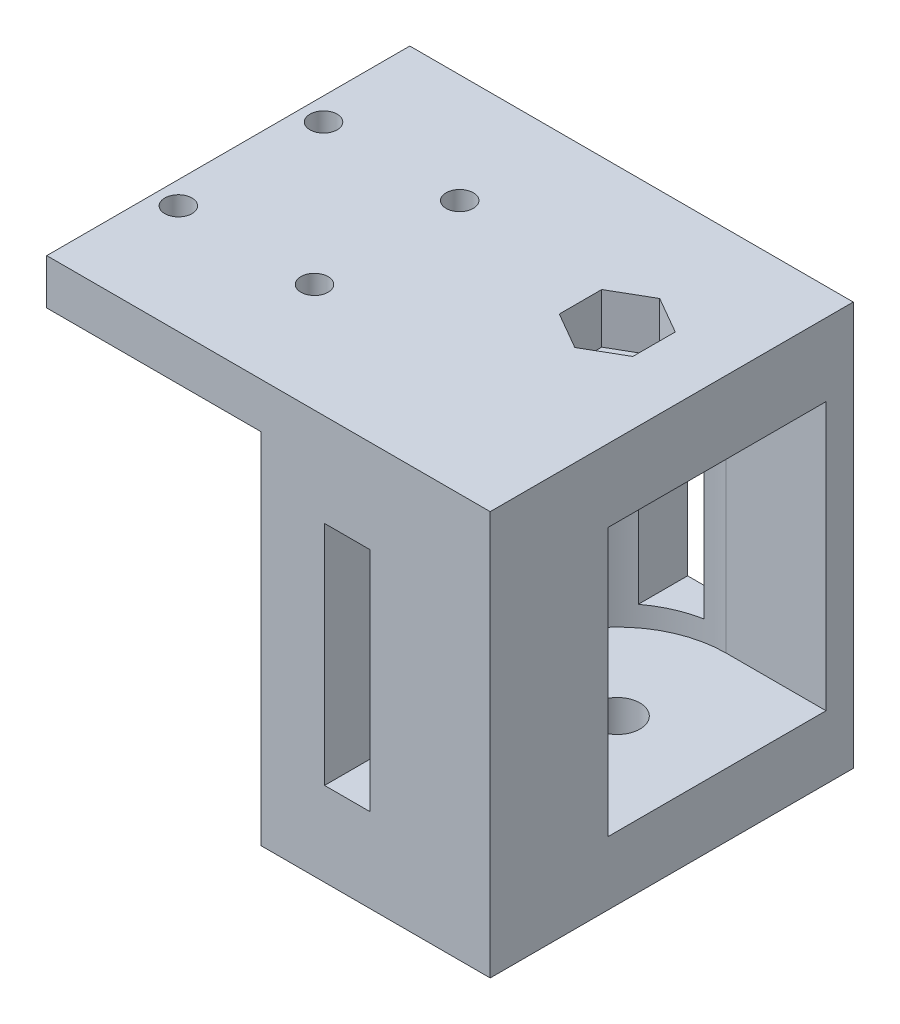
ISO-10303-21;
HEADER;
FILE_DESCRIPTION(('STEP AP214'),'2;1');
FILE_NAME('part.step','',(''),(''),'','','');
FILE_SCHEMA(('AUTOMOTIVE_DESIGN { 1 0 10303 214 1 1 1 1 }'));
ENDSEC;
DATA;
#1=APPLICATION_CONTEXT('core data for automotive mechanical design processes');
#2=APPLICATION_PROTOCOL_DEFINITION('international standard','automotive_design',2000,#1);
#3=PRODUCT_CONTEXT('',#1,'mechanical');
#4=PRODUCT('Part','Part','',(#3));
#5=PRODUCT_RELATED_PRODUCT_CATEGORY('part','',(#4));
#6=PRODUCT_DEFINITION_FORMATION('','',#4);
#7=PRODUCT_DEFINITION_CONTEXT('part definition',#1,'design');
#8=PRODUCT_DEFINITION('design','',#6,#7);
#9=PRODUCT_DEFINITION_SHAPE('','',#8);
#10=(LENGTH_UNIT() NAMED_UNIT(*) SI_UNIT(.MILLI.,.METRE.));
#11=(NAMED_UNIT(*) PLANE_ANGLE_UNIT() SI_UNIT($,.RADIAN.));
#12=(NAMED_UNIT(*) SI_UNIT($,.STERADIAN.) SOLID_ANGLE_UNIT());
#13=UNCERTAINTY_MEASURE_WITH_UNIT(LENGTH_MEASURE(1.E-05),#10,'distance_accuracy_value','');
#14=(GEOMETRIC_REPRESENTATION_CONTEXT(3) GLOBAL_UNCERTAINTY_ASSIGNED_CONTEXT((#13)) GLOBAL_UNIT_ASSIGNED_CONTEXT((#10,
#11,#12)) REPRESENTATION_CONTEXT('',''));
#15=CARTESIAN_POINT('',(0.,0.,0.));
#16=DIRECTION('',(0.,0.,1.));
#17=DIRECTION('',(1.,0.,0.));
#18=AXIS2_PLACEMENT_3D('',#15,#16,#17);
#19=CARTESIAN_POINT('',(37.86,-22.25,0.));
#20=DIRECTION('',(0.,1.,0.));
#21=DIRECTION('',(0.,0.,1.));
#22=AXIS2_PLACEMENT_3D('',#19,#20,#21);
#23=CYLINDRICAL_SURFACE('',#22,2.5);
#24=CARTESIAN_POINT('',(37.86,14.25,0.));
#25=DIRECTION('',(0.,1.,0.));
#26=DIRECTION('',(0.,0.,1.));
#27=AXIS2_PLACEMENT_3D('',#24,#25,#26);
#28=CIRCLE('',#27,2.5);
#29=CARTESIAN_POINT('',(37.86,14.25,2.5));
#30=VERTEX_POINT('',#29);
#31=EDGE_CURVE('E260',#30,#30,#28,.T.);
#32=ORIENTED_EDGE('',*,*,#31,.F.);
#33=EDGE_LOOP('',(#32));
#34=FACE_BOUND('',#33,.T.);
#35=CARTESIAN_POINT('',(37.86,16.75,0.));
#36=DIRECTION('',(0.,1.,0.));
#37=DIRECTION('',(-1.,0.,0.));
#38=AXIS2_PLACEMENT_3D('',#35,#36,#37);
#39=CIRCLE('',#38,2.5);
#40=CARTESIAN_POINT('',(35.36,16.75,0.));
#41=VERTEX_POINT('',#40);
#42=EDGE_CURVE('E39',#41,#41,#39,.F.);
#43=ORIENTED_EDGE('',*,*,#42,.F.);
#44=EDGE_LOOP('',(#43));
#45=FACE_BOUND('',#44,.T.);
#46=ADVANCED_FACE('F35',(#34,#45),#23,.F.);
#47=CARTESIAN_POINT('',(30.61,0.,-15.));
#48=DIRECTION('',(1.,0.,0.));
#49=DIRECTION('',(0.,0.,-1.));
#50=AXIS2_PLACEMENT_3D('',#47,#48,#49);
#51=PLANE('',#50);
#52=DIRECTION('',(0.,1.,0.));
#53=VECTOR('',#52,1.);
#54=CARTESIAN_POINT('',(30.61,-15.25,-9.56229574945264));
#55=LINE('',#54,#53);
#56=CARTESIAN_POINT('',(30.61,-13.,-9.56229574945264));
#57=VERTEX_POINT('',#56);
#58=CARTESIAN_POINT('',(30.61,12.,-9.56229574945264));
#59=VERTEX_POINT('',#58);
#60=EDGE_CURVE('E299',#57,#59,#55,.T.);
#61=ORIENTED_EDGE('',*,*,#60,.F.);
#62=DIRECTION('',(0.,0.,1.));
#63=VECTOR('',#62,1.);
#64=CARTESIAN_POINT('',(30.61,-13.,-15.));
#65=LINE('',#64,#63);
#66=CARTESIAN_POINT('',(30.61,-13.,-15.));
#67=VERTEX_POINT('',#66);
#68=EDGE_CURVE('E364',#67,#57,#65,.T.);
#69=ORIENTED_EDGE('',*,*,#68,.F.);
#70=DIRECTION('',(0.,1.,0.));
#71=VECTOR('',#70,1.);
#72=CARTESIAN_POINT('',(30.61,0.,-15.));
#73=LINE('',#72,#71);
#74=CARTESIAN_POINT('',(30.61,12.,-15.));
#75=VERTEX_POINT('',#74);
#76=EDGE_CURVE('E352',#67,#75,#73,.T.);
#77=ORIENTED_EDGE('',*,*,#76,.T.);
#78=DIRECTION('',(0.,0.,1.));
#79=VECTOR('',#78,1.);
#80=CARTESIAN_POINT('',(30.61,12.,-15.));
#81=LINE('',#80,#79);
#82=EDGE_CURVE('E376',#75,#59,#81,.T.);
#83=ORIENTED_EDGE('',*,*,#82,.T.);
#84=EDGE_LOOP('',(#61,#69,#77,#83));
#85=FACE_BOUND('',#84,.T.);
#86=ADVANCED_FACE('F397',(#85),#51,.T.);
#87=CARTESIAN_POINT('',(0.,-13.,-15.));
#88=DIRECTION('',(0.,-1.,0.));
#89=DIRECTION('',(0.,0.,-1.));
#90=AXIS2_PLACEMENT_3D('',#87,#88,#89);
#91=PLANE('',#90);
#92=DIRECTION('',(0.,0.,1.));
#93=VECTOR('',#92,1.);
#94=CARTESIAN_POINT('',(35.61,-13.,-15.));
#95=LINE('',#94,#93);
#96=CARTESIAN_POINT('',(35.61,-13.,11.7871752341263));
#97=VERTEX_POINT('',#96);
#98=CARTESIAN_POINT('',(35.61,-13.,25.));
#99=VERTEX_POINT('',#98);
#100=EDGE_CURVE('E371',#97,#99,#95,.T.);
#101=ORIENTED_EDGE('',*,*,#100,.F.);
#102=CARTESIAN_POINT('',(37.86,-13.,0.));
#103=DIRECTION('',(0.,-1.,0.));
#104=DIRECTION('',(0.,0.,-1.));
#105=AXIS2_PLACEMENT_3D('',#102,#103,#104);
#106=CIRCLE('',#105,12.);
#107=CARTESIAN_POINT('',(30.61,-13.,9.56229574945264));
#108=VERTEX_POINT('',#107);
#109=EDGE_CURVE('E300',#97,#108,#106,.T.);
#110=ORIENTED_EDGE('',*,*,#109,.T.);
#111=CARTESIAN_POINT('',(30.61,-13.,25.));
#112=VERTEX_POINT('',#111);
#113=EDGE_CURVE('E367',#108,#112,#65,.T.);
#114=ORIENTED_EDGE('',*,*,#113,.T.);
#115=DIRECTION('',(1.,0.,0.));
#116=VECTOR('',#115,1.);
#117=CARTESIAN_POINT('',(0.,-13.,25.));
#118=LINE('',#117,#116);
#119=EDGE_CURVE('E334',#112,#99,#118,.T.);
#120=ORIENTED_EDGE('',*,*,#119,.T.);
#121=EDGE_LOOP('',(#101,#110,#114,#120));
#122=FACE_BOUND('',#121,.T.);
#123=ADVANCED_FACE('F465',(#122),#91,.F.);
#124=CARTESIAN_POINT('',(35.61,0.,-15.));
#125=DIRECTION('',(1.,0.,0.));
#126=DIRECTION('',(0.,0.,-1.));
#127=AXIS2_PLACEMENT_3D('',#124,#125,#126);
#128=PLANE('',#127);
#129=CARTESIAN_POINT('',(35.61,-13.,-15.));
#130=VERTEX_POINT('',#129);
#131=CARTESIAN_POINT('',(35.61,-13.,-11.7871752341263));
#132=VERTEX_POINT('',#131);
#133=EDGE_CURVE('E368',#130,#132,#95,.T.);
#134=ORIENTED_EDGE('',*,*,#133,.T.);
#135=DIRECTION('',(0.,1.,0.));
#136=VECTOR('',#135,1.);
#137=CARTESIAN_POINT('',(35.61,-15.25,-11.7871752341263));
#138=LINE('',#137,#136);
#139=CARTESIAN_POINT('',(35.61,12.,-11.7871752341263));
#140=VERTEX_POINT('',#139);
#141=EDGE_CURVE('E287',#132,#140,#138,.T.);
#142=ORIENTED_EDGE('',*,*,#141,.T.);
#143=DIRECTION('',(0.,0.,1.));
#144=VECTOR('',#143,1.);
#145=CARTESIAN_POINT('',(35.61,12.,-15.));
#146=LINE('',#145,#144);
#147=CARTESIAN_POINT('',(35.61,12.,-15.));
#148=VERTEX_POINT('',#147);
#149=EDGE_CURVE('E372',#148,#140,#146,.T.);
#150=ORIENTED_EDGE('',*,*,#149,.F.);
#151=DIRECTION('',(0.,1.,0.));
#152=VECTOR('',#151,1.);
#153=CARTESIAN_POINT('',(35.61,0.,-15.));
#154=LINE('',#153,#152);
#155=EDGE_CURVE('E358',#130,#148,#154,.T.);
#156=ORIENTED_EDGE('',*,*,#155,.F.);
#157=EDGE_LOOP('',(#134,#142,#150,#156));
#158=FACE_BOUND('',#157,.T.);
#159=ADVANCED_FACE('F469',(#158),#128,.F.);
#160=CARTESIAN_POINT('',(48.86,0.,-15.));
#161=DIRECTION('',(1.,0.,0.));
#162=DIRECTION('',(0.,1.,0.));
#163=AXIS2_PLACEMENT_3D('',#160,#161,#162);
#164=PLANE('',#163);
#165=DIRECTION('',(0.,0.,1.));
#166=VECTOR('',#165,1.);
#167=CARTESIAN_POINT('',(48.86,22.25,-15.));
#168=LINE('',#167,#166);
#169=CARTESIAN_POINT('',(48.86,22.25,-15.));
#170=VERTEX_POINT('',#169);
#171=CARTESIAN_POINT('',(48.86,22.25,25.));
#172=VERTEX_POINT('',#171);
#173=EDGE_CURVE('E384',#170,#172,#168,.T.);
#174=ORIENTED_EDGE('',*,*,#173,.T.);
#175=DIRECTION('',(0.,1.,0.));
#176=VECTOR('',#175,1.);
#177=CARTESIAN_POINT('',(48.86,0.,25.));
#178=LINE('',#177,#176);
#179=CARTESIAN_POINT('',(48.86,-22.25,25.));
#180=VERTEX_POINT('',#179);
#181=EDGE_CURVE('E316',#180,#172,#178,.T.);
#182=ORIENTED_EDGE('',*,*,#181,.F.);
#183=DIRECTION('',(0.,0.,1.));
#184=VECTOR('',#183,1.);
#185=CARTESIAN_POINT('',(48.86,-22.25,-15.));
#186=LINE('',#185,#184);
#187=CARTESIAN_POINT('',(48.86,-22.25,-15.));
#188=VERTEX_POINT('',#187);
#189=EDGE_CURVE('E386',#188,#180,#186,.T.);
#190=ORIENTED_EDGE('',*,*,#189,.F.);
#191=DIRECTION('',(0.,1.,0.));
#192=VECTOR('',#191,1.);
#193=CARTESIAN_POINT('',(48.86,0.,-15.));
#194=LINE('',#193,#192);
#195=EDGE_CURVE('E344',#188,#170,#194,.T.);
#196=ORIENTED_EDGE('',*,*,#195,.T.);
#197=EDGE_LOOP('',(#174,#182,#190,#196));
#198=FACE_BOUND('',#197,.T.);
#199=DIRECTION('',(0.,1.,0.));
#200=VECTOR('',#199,1.);
#201=CARTESIAN_POINT('',(48.86,-15.25,-12.));
#202=LINE('',#201,#200);
#203=CARTESIAN_POINT('',(48.86,-15.25,-12.));
#204=VERTEX_POINT('',#203);
#205=CARTESIAN_POINT('',(48.86,14.25,-12.));
#206=VERTEX_POINT('',#205);
#207=EDGE_CURVE('E288',#204,#206,#202,.T.);
#208=ORIENTED_EDGE('',*,*,#207,.F.);
#209=DIRECTION('',(0.,0.,-1.));
#210=VECTOR('',#209,1.);
#211=CARTESIAN_POINT('',(48.86,-15.25,-12.));
#212=LINE('',#211,#210);
#213=CARTESIAN_POINT('',(48.86,-15.25,12.));
#214=VERTEX_POINT('',#213);
#215=EDGE_CURVE('E279',#214,#204,#212,.T.);
#216=ORIENTED_EDGE('',*,*,#215,.F.);
#217=DIRECTION('',(0.,1.,0.));
#218=VECTOR('',#217,1.);
#219=CARTESIAN_POINT('',(48.86,-15.25,12.));
#220=LINE('',#219,#218);
#221=CARTESIAN_POINT('',(48.86,14.25,12.));
#222=VERTEX_POINT('',#221);
#223=EDGE_CURVE('E290',#214,#222,#220,.T.);
#224=ORIENTED_EDGE('',*,*,#223,.T.);
#225=DIRECTION('',(0.,0.,-1.));
#226=VECTOR('',#225,1.);
#227=CARTESIAN_POINT('',(48.86,14.25,-12.));
#228=LINE('',#227,#226);
#229=EDGE_CURVE('E269',#222,#206,#228,.T.);
#230=ORIENTED_EDGE('',*,*,#229,.T.);
#231=EDGE_LOOP('',(#208,#216,#224,#230));
#232=FACE_BOUND('',#231,.T.);
#233=ADVANCED_FACE('F487',(#198,#232),#164,.T.);
#234=CARTESIAN_POINT('',(0.,12.,-15.));
#235=DIRECTION('',(0.,-1.,0.));
#236=DIRECTION('',(0.,0.,-1.));
#237=AXIS2_PLACEMENT_3D('',#234,#235,#236);
#238=PLANE('',#237);
#239=CARTESIAN_POINT('',(37.86,12.,0.));
#240=DIRECTION('',(0.,-1.,0.));
#241=DIRECTION('',(0.,0.,-1.));
#242=AXIS2_PLACEMENT_3D('',#239,#240,#241);
#243=CIRCLE('',#242,12.);
#244=CARTESIAN_POINT('',(35.61,12.,11.7871752341263));
#245=VERTEX_POINT('',#244);
#246=CARTESIAN_POINT('',(30.61,12.,9.56229574945264));
#247=VERTEX_POINT('',#246);
#248=EDGE_CURVE('E11',#245,#247,#243,.T.);
#249=ORIENTED_EDGE('',*,*,#248,.F.);
#250=CARTESIAN_POINT('',(35.61,12.,25.));
#251=VERTEX_POINT('',#250);
#252=EDGE_CURVE('E375',#245,#251,#146,.T.);
#253=ORIENTED_EDGE('',*,*,#252,.T.);
#254=DIRECTION('',(1.,0.,0.));
#255=VECTOR('',#254,1.);
#256=CARTESIAN_POINT('',(0.,12.,25.));
#257=LINE('',#256,#255);
#258=CARTESIAN_POINT('',(30.61,12.,25.));
#259=VERTEX_POINT('',#258);
#260=EDGE_CURVE('E328',#259,#251,#257,.T.);
#261=ORIENTED_EDGE('',*,*,#260,.F.);
#262=EDGE_CURVE('E379',#247,#259,#81,.T.);
#263=ORIENTED_EDGE('',*,*,#262,.F.);
#264=EDGE_LOOP('',(#249,#253,#261,#263));
#265=FACE_BOUND('',#264,.T.);
#266=ADVANCED_FACE('F474',(#265),#238,.T.);
#267=DIRECTION('',(0.,1.,0.));
#268=VECTOR('',#267,1.);
#269=CARTESIAN_POINT('',(30.61,-15.25,9.56229574945264));
#270=LINE('',#269,#268);
#271=EDGE_CURVE('E305',#247,#108,#270,.F.);
#272=ORIENTED_EDGE('',*,*,#271,.F.);
#273=ORIENTED_EDGE('',*,*,#262,.T.);
#274=DIRECTION('',(0.,1.,0.));
#275=VECTOR('',#274,1.);
#276=CARTESIAN_POINT('',(30.61,0.,25.));
#277=LINE('',#276,#275);
#278=EDGE_CURVE('E325',#112,#259,#277,.T.);
#279=ORIENTED_EDGE('',*,*,#278,.F.);
#280=ORIENTED_EDGE('',*,*,#113,.F.);
#281=EDGE_LOOP('',(#272,#273,#279,#280));
#282=FACE_BOUND('',#281,.T.);
#283=ADVANCED_FACE('F463',(#282),#51,.T.);
#284=ORIENTED_EDGE('',*,*,#68,.T.);
#285=EDGE_CURVE('E296',#57,#132,#106,.T.);
#286=ORIENTED_EDGE('',*,*,#285,.T.);
#287=ORIENTED_EDGE('',*,*,#133,.F.);
#288=DIRECTION('',(1.,0.,0.));
#289=VECTOR('',#288,1.);
#290=CARTESIAN_POINT('',(0.,-13.,-15.));
#291=LINE('',#290,#289);
#292=EDGE_CURVE('E360',#67,#130,#291,.T.);
#293=ORIENTED_EDGE('',*,*,#292,.F.);
#294=EDGE_LOOP('',(#284,#286,#287,#293));
#295=FACE_BOUND('',#294,.T.);
#296=ADVANCED_FACE('F459',(#295),#91,.F.);
#297=ORIENTED_EDGE('',*,*,#252,.F.);
#298=DIRECTION('',(0.,1.,0.));
#299=VECTOR('',#298,1.);
#300=CARTESIAN_POINT('',(35.61,-15.25,11.7871752341263));
#301=LINE('',#300,#299);
#302=EDGE_CURVE('E302',#245,#97,#301,.F.);
#303=ORIENTED_EDGE('',*,*,#302,.T.);
#304=ORIENTED_EDGE('',*,*,#100,.T.);
#305=DIRECTION('',(0.,1.,0.));
#306=VECTOR('',#305,1.);
#307=CARTESIAN_POINT('',(35.61,0.,25.));
#308=LINE('',#307,#306);
#309=EDGE_CURVE('E331',#99,#251,#308,.T.);
#310=ORIENTED_EDGE('',*,*,#309,.T.);
#311=EDGE_LOOP('',(#297,#303,#304,#310));
#312=FACE_BOUND('',#311,.T.);
#313=ADVANCED_FACE('F462',(#312),#128,.F.);
#314=CARTESIAN_POINT('',(0.,17.25,-15.));
#315=DIRECTION('',(0.,1.,0.));
#316=DIRECTION('',(-1.,0.,0.));
#317=AXIS2_PLACEMENT_3D('',#314,#315,#316);
#318=PLANE('',#317);
#319=CARTESIAN_POINT('',(2.5,17.25,13.));
#320=DIRECTION('',(0.,1.,0.));
#321=DIRECTION('',(-1.,0.,0.));
#322=AXIS2_PLACEMENT_3D('',#319,#320,#321);
#323=CIRCLE('',#322,1.5);
#324=CARTESIAN_POINT('',(1.,17.25,13.));
#325=VERTEX_POINT('',#324);
#326=EDGE_CURVE('E708',#325,#325,#323,.T.);
#327=ORIENTED_EDGE('',*,*,#326,.T.);
#328=EDGE_LOOP('',(#327));
#329=FACE_BOUND('',#328,.T.);
#330=CARTESIAN_POINT('',(17.5,17.25,13.));
#331=DIRECTION('',(0.,1.,0.));
#332=DIRECTION('',(-1.,0.,0.));
#333=AXIS2_PLACEMENT_3D('',#330,#331,#332);
#334=CIRCLE('',#333,1.5);
#335=CARTESIAN_POINT('',(16.,17.25,13.));
#336=VERTEX_POINT('',#335);
#337=EDGE_CURVE('E712',#336,#336,#334,.T.);
#338=ORIENTED_EDGE('',*,*,#337,.T.);
#339=EDGE_LOOP('',(#338));
#340=FACE_BOUND('',#339,.T.);
#341=CARTESIAN_POINT('',(17.5,17.25,-2.99999999999999));
#342=DIRECTION('',(0.,1.,0.));
#343=DIRECTION('',(-1.,0.,0.));
#344=AXIS2_PLACEMENT_3D('',#341,#342,#343);
#345=CIRCLE('',#344,1.5);
#346=CARTESIAN_POINT('',(16.,17.25,-2.99999999999999));
#347=VERTEX_POINT('',#346);
#348=EDGE_CURVE('E721',#347,#347,#345,.T.);
#349=ORIENTED_EDGE('',*,*,#348,.T.);
#350=EDGE_LOOP('',(#349));
#351=FACE_BOUND('',#350,.T.);
#352=CARTESIAN_POINT('',(2.5,17.25,-2.99999999999999));
#353=DIRECTION('',(0.,1.,0.));
#354=DIRECTION('',(-1.,0.,0.));
#355=AXIS2_PLACEMENT_3D('',#352,#353,#354);
#356=CIRCLE('',#355,1.5);
#357=CARTESIAN_POINT('',(0.999999999999998,17.25,-2.99999999999999));
#358=VERTEX_POINT('',#357);
#359=EDGE_CURVE('E227',#358,#358,#356,.T.);
#360=ORIENTED_EDGE('',*,*,#359,.T.);
#361=EDGE_LOOP('',(#360));
#362=FACE_BOUND('',#361,.T.);
#363=DIRECTION('',(0.,0.,1.));
#364=VECTOR('',#363,1.);
#365=CARTESIAN_POINT('',(23.61,17.25,-15.));
#366=LINE('',#365,#364);
#367=CARTESIAN_POINT('',(23.61,17.25,-15.));
#368=VERTEX_POINT('',#367);
#369=CARTESIAN_POINT('',(23.61,17.25,25.));
#370=VERTEX_POINT('',#369);
#371=EDGE_CURVE('E363',#368,#370,#366,.T.);
#372=ORIENTED_EDGE('',*,*,#371,.T.);
#373=DIRECTION('',(-1.,0.,0.));
#374=VECTOR('',#373,1.);
#375=CARTESIAN_POINT('',(0.,17.25,25.));
#376=LINE('',#375,#374);
#377=CARTESIAN_POINT('',(0.,17.25,25.));
#378=VERTEX_POINT('',#377);
#379=EDGE_CURVE('E307',#370,#378,#376,.T.);
#380=ORIENTED_EDGE('',*,*,#379,.T.);
#381=DIRECTION('',(0.,0.,1.));
#382=VECTOR('',#381,1.);
#383=CARTESIAN_POINT('',(0.,17.25,-15.));
#384=LINE('',#383,#382);
#385=CARTESIAN_POINT('',(0.,17.25,-15.));
#386=VERTEX_POINT('',#385);
#387=EDGE_CURVE('E380',#386,#378,#384,.T.);
#388=ORIENTED_EDGE('',*,*,#387,.F.);
#389=DIRECTION('',(-1.,0.,0.));
#390=VECTOR('',#389,1.);
#391=CARTESIAN_POINT('',(0.,17.25,-15.));
#392=LINE('',#391,#390);
#393=EDGE_CURVE('E337',#368,#386,#392,.T.);
#394=ORIENTED_EDGE('',*,*,#393,.F.);
#395=EDGE_LOOP('',(#372,#380,#388,#394));
#396=FACE_BOUND('',#395,.T.);
#397=ADVANCED_FACE('F37',(#329,#340,#351,#362,#396),#318,.F.);
#398=CARTESIAN_POINT('',(0.,0.,-15.));
#399=DIRECTION('',(1.,0.,0.));
#400=DIRECTION('',(0.,1.,0.));
#401=AXIS2_PLACEMENT_3D('',#398,#399,#400);
#402=PLANE('',#401);
#403=ORIENTED_EDGE('',*,*,#387,.T.);
#404=DIRECTION('',(0.,1.,0.));
#405=VECTOR('',#404,1.);
#406=CARTESIAN_POINT('',(0.,0.,25.));
#407=LINE('',#406,#405);
#408=CARTESIAN_POINT('',(0.,22.25,25.));
#409=VERTEX_POINT('',#408);
#410=EDGE_CURVE('E322',#378,#409,#407,.T.);
#411=ORIENTED_EDGE('',*,*,#410,.T.);
#412=DIRECTION('',(0.,0.,1.));
#413=VECTOR('',#412,1.);
#414=CARTESIAN_POINT('',(0.,22.25,-15.));
#415=LINE('',#414,#413);
#416=CARTESIAN_POINT('',(0.,22.25,-15.));
#417=VERTEX_POINT('',#416);
#418=EDGE_CURVE('E382',#417,#409,#415,.T.);
#419=ORIENTED_EDGE('',*,*,#418,.F.);
#420=DIRECTION('',(0.,1.,0.));
#421=VECTOR('',#420,1.);
#422=CARTESIAN_POINT('',(0.,0.,-15.));
#423=LINE('',#422,#421);
#424=EDGE_CURVE('E350',#386,#417,#423,.T.);
#425=ORIENTED_EDGE('',*,*,#424,.F.);
#426=EDGE_LOOP('',(#403,#411,#419,#425));
#427=FACE_BOUND('',#426,.T.);
#428=ADVANCED_FACE('F478',(#427),#402,.F.);
#429=CARTESIAN_POINT('',(0.,22.25,-15.));
#430=DIRECTION('',(0.,1.,0.));
#431=DIRECTION('',(-1.,0.,0.));
#432=AXIS2_PLACEMENT_3D('',#429,#430,#431);
#433=PLANE('',#432);
#434=CARTESIAN_POINT('',(2.5,22.25,13.));
#435=DIRECTION('',(0.,1.,0.));
#436=DIRECTION('',(-1.,0.,0.));
#437=AXIS2_PLACEMENT_3D('',#434,#435,#436);
#438=CIRCLE('',#437,1.5);
#439=CARTESIAN_POINT('',(1.,22.25,13.));
#440=VERTEX_POINT('',#439);
#441=EDGE_CURVE('E705',#440,#440,#438,.T.);
#442=ORIENTED_EDGE('',*,*,#441,.F.);
#443=EDGE_LOOP('',(#442));
#444=FACE_BOUND('',#443,.T.);
#445=CARTESIAN_POINT('',(17.5,22.25,13.));
#446=DIRECTION('',(0.,1.,0.));
#447=DIRECTION('',(-1.,0.,0.));
#448=AXIS2_PLACEMENT_3D('',#445,#446,#447);
#449=CIRCLE('',#448,1.5);
#450=CARTESIAN_POINT('',(16.,22.25,13.));
#451=VERTEX_POINT('',#450);
#452=EDGE_CURVE('E709',#451,#451,#449,.T.);
#453=ORIENTED_EDGE('',*,*,#452,.F.);
#454=EDGE_LOOP('',(#453));
#455=FACE_BOUND('',#454,.T.);
#456=CARTESIAN_POINT('',(17.5,22.25,-2.99999999999999));
#457=DIRECTION('',(0.,1.,0.));
#458=DIRECTION('',(-1.,0.,0.));
#459=AXIS2_PLACEMENT_3D('',#456,#457,#458);
#460=CIRCLE('',#459,1.5);
#461=CARTESIAN_POINT('',(16.,22.25,-2.99999999999999));
#462=VERTEX_POINT('',#461);
#463=EDGE_CURVE('E718',#462,#462,#460,.T.);
#464=ORIENTED_EDGE('',*,*,#463,.F.);
#465=EDGE_LOOP('',(#464));
#466=FACE_BOUND('',#465,.T.);
#467=CARTESIAN_POINT('',(2.49999999999999,22.25,-2.99999999999999));
#468=DIRECTION('',(0.,1.,0.));
#469=DIRECTION('',(-1.,0.,0.));
#470=AXIS2_PLACEMENT_3D('',#467,#468,#469);
#471=CIRCLE('',#470,1.5);
#472=CARTESIAN_POINT('',(0.999999999999997,22.25,-2.99999999999999));
#473=VERTEX_POINT('',#472);
#474=EDGE_CURVE('E723',#473,#473,#471,.T.);
#475=ORIENTED_EDGE('',*,*,#474,.F.);
#476=EDGE_LOOP('',(#475));
#477=FACE_BOUND('',#476,.T.);
#478=DIRECTION('',(0.,0.,-1.));
#479=VECTOR('',#478,1.);
#480=CARTESIAN_POINT('',(41.91,22.25,2.33826859021797));
#481=LINE('',#480,#479);
#482=CARTESIAN_POINT('',(41.91,22.25,2.33826859021797));
#483=VERTEX_POINT('',#482);
#484=CARTESIAN_POINT('',(41.91,22.25,-2.33826859021798));
#485=VERTEX_POINT('',#484);
#486=EDGE_CURVE('E52',#483,#485,#481,.T.);
#487=ORIENTED_EDGE('',*,*,#486,.F.);
#488=DIRECTION('',(0.866025403784439,0.,-0.5));
#489=VECTOR('',#488,1.);
#490=CARTESIAN_POINT('',(37.86,22.25,4.67653718043596));
#491=LINE('',#490,#489);
#492=CARTESIAN_POINT('',(37.86,22.25,4.67653718043596));
#493=VERTEX_POINT('',#492);
#494=EDGE_CURVE('E221',#493,#483,#491,.T.);
#495=ORIENTED_EDGE('',*,*,#494,.F.);
#496=DIRECTION('',(0.866025403784439,0.,0.5));
#497=VECTOR('',#496,1.);
#498=CARTESIAN_POINT('',(33.81,22.25,2.33826859021798));
#499=LINE('',#498,#497);
#500=CARTESIAN_POINT('',(33.81,22.25,2.33826859021798));
#501=VERTEX_POINT('',#500);
#502=EDGE_CURVE('E224',#501,#493,#499,.T.);
#503=ORIENTED_EDGE('',*,*,#502,.F.);
#504=DIRECTION('',(0.,0.,1.));
#505=VECTOR('',#504,1.);
#506=CARTESIAN_POINT('',(33.81,22.25,-2.33826859021799));
#507=LINE('',#506,#505);
#508=CARTESIAN_POINT('',(33.81,22.25,-2.33826859021799));
#509=VERTEX_POINT('',#508);
#510=EDGE_CURVE('E243',#509,#501,#507,.T.);
#511=ORIENTED_EDGE('',*,*,#510,.F.);
#512=DIRECTION('',(-0.866025403784438,0.,0.500000000000001));
#513=VECTOR('',#512,1.);
#514=CARTESIAN_POINT('',(37.86,22.25,-4.67653718043597));
#515=LINE('',#514,#513);
#516=CARTESIAN_POINT('',(37.86,22.25,-4.67653718043597));
#517=VERTEX_POINT('',#516);
#518=EDGE_CURVE('E240',#517,#509,#515,.T.);
#519=ORIENTED_EDGE('',*,*,#518,.F.);
#520=DIRECTION('',(-0.866025403784439,0.,-0.499999999999999));
#521=VECTOR('',#520,1.);
#522=CARTESIAN_POINT('',(41.91,22.25,-2.33826859021798));
#523=LINE('',#522,#521);
#524=EDGE_CURVE('E238',#485,#517,#523,.T.);
#525=ORIENTED_EDGE('',*,*,#524,.F.);
#526=EDGE_LOOP('',(#487,#495,#503,#511,#519,#525));
#527=FACE_BOUND('',#526,.T.);
#528=ORIENTED_EDGE('',*,*,#418,.T.);
#529=DIRECTION('',(-1.,0.,0.));
#530=VECTOR('',#529,1.);
#531=CARTESIAN_POINT('',(0.,22.25,25.));
#532=LINE('',#531,#530);
#533=EDGE_CURVE('E319',#172,#409,#532,.T.);
#534=ORIENTED_EDGE('',*,*,#533,.F.);
#535=ORIENTED_EDGE('',*,*,#173,.F.);
#536=DIRECTION('',(-1.,0.,0.));
#537=VECTOR('',#536,1.);
#538=CARTESIAN_POINT('',(0.,22.25,-15.));
#539=LINE('',#538,#537);
#540=EDGE_CURVE('E347',#170,#417,#539,.T.);
#541=ORIENTED_EDGE('',*,*,#540,.T.);
#542=EDGE_LOOP('',(#528,#534,#535,#541));
#543=FACE_BOUND('',#542,.T.);
#544=ADVANCED_FACE('F481',(#444,#455,#466,#477,#527,#543),#433,.T.);
#545=CARTESIAN_POINT('',(0.,-22.25,-15.));
#546=DIRECTION('',(0.,1.,0.));
#547=DIRECTION('',(0.,0.,1.));
#548=AXIS2_PLACEMENT_3D('',#545,#546,#547);
#549=PLANE('',#548);
#550=CARTESIAN_POINT('',(37.86,-22.25,0.));
#551=DIRECTION('',(0.,1.,0.));
#552=DIRECTION('',(0.,0.,1.));
#553=AXIS2_PLACEMENT_3D('',#550,#551,#552);
#554=CIRCLE('',#553,2.5);
#555=CARTESIAN_POINT('',(37.86,-22.25,2.5));
#556=VERTEX_POINT('',#555);
#557=EDGE_CURVE('E257',#556,#556,#554,.T.);
#558=ORIENTED_EDGE('',*,*,#557,.T.);
#559=EDGE_LOOP('',(#558));
#560=FACE_BOUND('',#559,.T.);
#561=ORIENTED_EDGE('',*,*,#189,.T.);
#562=DIRECTION('',(-1.,0.,0.));
#563=VECTOR('',#562,1.);
#564=CARTESIAN_POINT('',(0.,-22.25,25.));
#565=LINE('',#564,#563);
#566=CARTESIAN_POINT('',(23.61,-22.25,25.));
#567=VERTEX_POINT('',#566);
#568=EDGE_CURVE('E313',#180,#567,#565,.T.);
#569=ORIENTED_EDGE('',*,*,#568,.T.);
#570=DIRECTION('',(0.,0.,1.));
#571=VECTOR('',#570,1.);
#572=CARTESIAN_POINT('',(23.61,-22.25,-15.));
#573=LINE('',#572,#571);
#574=CARTESIAN_POINT('',(23.61,-22.25,-15.));
#575=VERTEX_POINT('',#574);
#576=EDGE_CURVE('E388',#575,#567,#573,.T.);
#577=ORIENTED_EDGE('',*,*,#576,.F.);
#578=DIRECTION('',(-1.,0.,0.));
#579=VECTOR('',#578,1.);
#580=CARTESIAN_POINT('',(0.,-22.25,-15.));
#581=LINE('',#580,#579);
#582=EDGE_CURVE('E342',#188,#575,#581,.T.);
#583=ORIENTED_EDGE('',*,*,#582,.F.);
#584=EDGE_LOOP('',(#561,#569,#577,#583));
#585=FACE_BOUND('',#584,.T.);
#586=ADVANCED_FACE('F485',(#560,#585),#549,.F.);
#587=CARTESIAN_POINT('',(23.61,0.,-15.));
#588=DIRECTION('',(1.,0.,0.));
#589=DIRECTION('',(0.,0.,-1.));
#590=AXIS2_PLACEMENT_3D('',#587,#588,#589);
#591=PLANE('',#590);
#592=ORIENTED_EDGE('',*,*,#576,.T.);
#593=DIRECTION('',(0.,1.,0.));
#594=VECTOR('',#593,1.);
#595=CARTESIAN_POINT('',(23.61,0.,25.));
#596=LINE('',#595,#594);
#597=EDGE_CURVE('E310',#567,#370,#596,.T.);
#598=ORIENTED_EDGE('',*,*,#597,.T.);
#599=ORIENTED_EDGE('',*,*,#371,.F.);
#600=DIRECTION('',(0.,1.,0.));
#601=VECTOR('',#600,1.);
#602=CARTESIAN_POINT('',(23.61,0.,-15.));
#603=LINE('',#602,#601);
#604=EDGE_CURVE('E340',#575,#368,#603,.T.);
#605=ORIENTED_EDGE('',*,*,#604,.F.);
#606=EDGE_LOOP('',(#592,#598,#599,#605));
#607=FACE_BOUND('',#606,.T.);
#608=ADVANCED_FACE('F472',(#607),#591,.F.);
#609=EDGE_CURVE('E44',#59,#140,#243,.T.);
#610=ORIENTED_EDGE('',*,*,#609,.F.);
#611=ORIENTED_EDGE('',*,*,#82,.F.);
#612=DIRECTION('',(1.,0.,0.));
#613=VECTOR('',#612,1.);
#614=CARTESIAN_POINT('',(0.,12.,-15.));
#615=LINE('',#614,#613);
#616=EDGE_CURVE('E355',#75,#148,#615,.T.);
#617=ORIENTED_EDGE('',*,*,#616,.T.);
#618=ORIENTED_EDGE('',*,*,#149,.T.);
#619=EDGE_LOOP('',(#610,#611,#617,#618));
#620=FACE_BOUND('',#619,.T.);
#621=ADVANCED_FACE('F457',(#620),#238,.T.);
#622=CARTESIAN_POINT('',(0.,0.,-15.));
#623=DIRECTION('',(0.,0.,1.));
#624=DIRECTION('',(1.,0.,0.));
#625=AXIS2_PLACEMENT_3D('',#622,#623,#624);
#626=PLANE('',#625);
#627=ORIENTED_EDGE('',*,*,#393,.T.);
#628=ORIENTED_EDGE('',*,*,#424,.T.);
#629=ORIENTED_EDGE('',*,*,#540,.F.);
#630=ORIENTED_EDGE('',*,*,#195,.F.);
#631=ORIENTED_EDGE('',*,*,#582,.T.);
#632=ORIENTED_EDGE('',*,*,#604,.T.);
#633=EDGE_LOOP('',(#627,#628,#629,#630,#631,#632));
#634=FACE_BOUND('',#633,.T.);
#635=ORIENTED_EDGE('',*,*,#76,.F.);
#636=ORIENTED_EDGE('',*,*,#292,.T.);
#637=ORIENTED_EDGE('',*,*,#155,.T.);
#638=ORIENTED_EDGE('',*,*,#616,.F.);
#639=EDGE_LOOP('',(#635,#636,#637,#638));
#640=FACE_BOUND('',#639,.T.);
#641=ADVANCED_FACE('F453',(#634,#640),#626,.F.);
#642=CARTESIAN_POINT('',(0.,0.,25.));
#643=DIRECTION('',(0.,0.,1.));
#644=DIRECTION('',(1.,0.,0.));
#645=AXIS2_PLACEMENT_3D('',#642,#643,#644);
#646=PLANE('',#645);
#647=ORIENTED_EDGE('',*,*,#379,.F.);
#648=ORIENTED_EDGE('',*,*,#597,.F.);
#649=ORIENTED_EDGE('',*,*,#568,.F.);
#650=ORIENTED_EDGE('',*,*,#181,.T.);
#651=ORIENTED_EDGE('',*,*,#533,.T.);
#652=ORIENTED_EDGE('',*,*,#410,.F.);
#653=EDGE_LOOP('',(#647,#648,#649,#650,#651,#652));
#654=FACE_BOUND('',#653,.T.);
#655=ORIENTED_EDGE('',*,*,#278,.T.);
#656=ORIENTED_EDGE('',*,*,#260,.T.);
#657=ORIENTED_EDGE('',*,*,#309,.F.);
#658=ORIENTED_EDGE('',*,*,#119,.F.);
#659=EDGE_LOOP('',(#655,#656,#657,#658));
#660=FACE_BOUND('',#659,.T.);
#661=ADVANCED_FACE('F449',(#654,#660),#646,.T.);
#662=CARTESIAN_POINT('',(37.86,-15.25,0.));
#663=DIRECTION('',(0.,1.,0.));
#664=DIRECTION('',(0.,0.,1.));
#665=AXIS2_PLACEMENT_3D('',#662,#663,#664);
#666=CYLINDRICAL_SURFACE('',#665,12.);
#667=ORIENTED_EDGE('',*,*,#271,.T.);
#668=ORIENTED_EDGE('',*,*,#109,.F.);
#669=ORIENTED_EDGE('',*,*,#302,.F.);
#670=ORIENTED_EDGE('',*,*,#248,.T.);
#671=EDGE_LOOP('',(#667,#668,#669,#670));
#672=FACE_BOUND('',#671,.T.);
#673=ORIENTED_EDGE('',*,*,#60,.T.);
#674=ORIENTED_EDGE('',*,*,#609,.T.);
#675=ORIENTED_EDGE('',*,*,#141,.F.);
#676=ORIENTED_EDGE('',*,*,#285,.F.);
#677=EDGE_LOOP('',(#673,#674,#675,#676));
#678=FACE_BOUND('',#677,.T.);
#679=DIRECTION('',(0.,1.,0.));
#680=VECTOR('',#679,1.);
#681=CARTESIAN_POINT('',(37.86,-15.25,12.));
#682=LINE('',#681,#680);
#683=CARTESIAN_POINT('',(37.86,-15.25,12.));
#684=VERTEX_POINT('',#683);
#685=CARTESIAN_POINT('',(37.86,14.25,12.));
#686=VERTEX_POINT('',#685);
#687=EDGE_CURVE('E284',#684,#686,#682,.T.);
#688=ORIENTED_EDGE('',*,*,#687,.F.);
#689=CARTESIAN_POINT('',(37.86,-15.25,0.));
#690=DIRECTION('',(0.,1.,0.));
#691=DIRECTION('',(0.,0.,1.));
#692=AXIS2_PLACEMENT_3D('',#689,#690,#691);
#693=CIRCLE('',#692,12.);
#694=CARTESIAN_POINT('',(37.86,-15.25,-12.));
#695=VERTEX_POINT('',#694);
#696=EDGE_CURVE('E273',#695,#684,#693,.T.);
#697=ORIENTED_EDGE('',*,*,#696,.F.);
#698=DIRECTION('',(0.,1.,0.));
#699=VECTOR('',#698,1.);
#700=CARTESIAN_POINT('',(37.86,-15.25,-12.));
#701=LINE('',#700,#699);
#702=CARTESIAN_POINT('',(37.86,14.25,-12.));
#703=VERTEX_POINT('',#702);
#704=EDGE_CURVE('E285',#695,#703,#701,.T.);
#705=ORIENTED_EDGE('',*,*,#704,.T.);
#706=CARTESIAN_POINT('',(37.86,14.25,0.));
#707=DIRECTION('',(0.,1.,0.));
#708=DIRECTION('',(0.,0.,1.));
#709=AXIS2_PLACEMENT_3D('',#706,#707,#708);
#710=CIRCLE('',#709,12.);
#711=EDGE_CURVE('E264',#703,#686,#710,.T.);
#712=ORIENTED_EDGE('',*,*,#711,.T.);
#713=EDGE_LOOP('',(#688,#697,#705,#712));
#714=FACE_BOUND('',#713,.T.);
#715=ADVANCED_FACE('F442',(#672,#678,#714),#666,.F.);
#716=CARTESIAN_POINT('',(37.86,-15.25,-12.));
#717=DIRECTION('',(0.,0.,-1.));
#718=DIRECTION('',(-1.,0.,0.));
#719=AXIS2_PLACEMENT_3D('',#716,#717,#718);
#720=PLANE('',#719);
#721=ORIENTED_EDGE('',*,*,#704,.F.);
#722=DIRECTION('',(-1.,0.,0.));
#723=VECTOR('',#722,1.);
#724=CARTESIAN_POINT('',(37.86,-15.25,-12.));
#725=LINE('',#724,#723);
#726=EDGE_CURVE('E281',#204,#695,#725,.T.);
#727=ORIENTED_EDGE('',*,*,#726,.F.);
#728=ORIENTED_EDGE('',*,*,#207,.T.);
#729=DIRECTION('',(-1.,0.,0.));
#730=VECTOR('',#729,1.);
#731=CARTESIAN_POINT('',(37.86,14.25,-12.));
#732=LINE('',#731,#730);
#733=EDGE_CURVE('E60',#206,#703,#732,.T.);
#734=ORIENTED_EDGE('',*,*,#733,.T.);
#735=EDGE_LOOP('',(#721,#727,#728,#734));
#736=FACE_BOUND('',#735,.T.);
#737=ADVANCED_FACE('F439',(#736),#720,.F.);
#738=CARTESIAN_POINT('',(37.86,-15.25,12.));
#739=DIRECTION('',(0.,0.,1.));
#740=DIRECTION('',(1.,0.,0.));
#741=AXIS2_PLACEMENT_3D('',#738,#739,#740);
#742=PLANE('',#741);
#743=ORIENTED_EDGE('',*,*,#223,.F.);
#744=DIRECTION('',(1.,0.,0.));
#745=VECTOR('',#744,1.);
#746=CARTESIAN_POINT('',(37.86,-15.25,12.));
#747=LINE('',#746,#745);
#748=EDGE_CURVE('E276',#684,#214,#747,.T.);
#749=ORIENTED_EDGE('',*,*,#748,.F.);
#750=ORIENTED_EDGE('',*,*,#687,.T.);
#751=DIRECTION('',(1.,0.,0.));
#752=VECTOR('',#751,1.);
#753=CARTESIAN_POINT('',(37.86,14.25,12.));
#754=LINE('',#753,#752);
#755=EDGE_CURVE('E267',#686,#222,#754,.T.);
#756=ORIENTED_EDGE('',*,*,#755,.T.);
#757=EDGE_LOOP('',(#743,#749,#750,#756));
#758=FACE_BOUND('',#757,.T.);
#759=ADVANCED_FACE('F437',(#758),#742,.F.);
#760=CARTESIAN_POINT('',(37.86,-15.25,0.));
#761=DIRECTION('',(0.,1.,0.));
#762=DIRECTION('',(0.,0.,1.));
#763=AXIS2_PLACEMENT_3D('',#760,#761,#762);
#764=PLANE('',#763);
#765=CARTESIAN_POINT('',(37.86,-15.25,0.));
#766=DIRECTION('',(0.,1.,0.));
#767=DIRECTION('',(0.,0.,1.));
#768=AXIS2_PLACEMENT_3D('',#765,#766,#767);
#769=CIRCLE('',#768,2.5);
#770=CARTESIAN_POINT('',(37.86,-15.25,2.5));
#771=VERTEX_POINT('',#770);
#772=EDGE_CURVE('E261',#771,#771,#769,.T.);
#773=ORIENTED_EDGE('',*,*,#772,.F.);
#774=EDGE_LOOP('',(#773));
#775=FACE_BOUND('',#774,.T.);
#776=ORIENTED_EDGE('',*,*,#696,.T.);
#777=ORIENTED_EDGE('',*,*,#748,.T.);
#778=ORIENTED_EDGE('',*,*,#215,.T.);
#779=ORIENTED_EDGE('',*,*,#726,.T.);
#780=EDGE_LOOP('',(#776,#777,#778,#779));
#781=FACE_BOUND('',#780,.T.);
#782=ADVANCED_FACE('F434',(#775,#781),#764,.T.);
#783=CARTESIAN_POINT('',(37.86,14.25,0.));
#784=DIRECTION('',(0.,1.,0.));
#785=DIRECTION('',(0.,0.,1.));
#786=AXIS2_PLACEMENT_3D('',#783,#784,#785);
#787=PLANE('',#786);
#788=ORIENTED_EDGE('',*,*,#31,.T.);
#789=EDGE_LOOP('',(#788));
#790=FACE_BOUND('',#789,.T.);
#791=ORIENTED_EDGE('',*,*,#711,.F.);
#792=ORIENTED_EDGE('',*,*,#733,.F.);
#793=ORIENTED_EDGE('',*,*,#229,.F.);
#794=ORIENTED_EDGE('',*,*,#755,.F.);
#795=EDGE_LOOP('',(#791,#792,#793,#794));
#796=FACE_BOUND('',#795,.T.);
#797=ADVANCED_FACE('F393',(#790,#796),#787,.F.);
#798=ORIENTED_EDGE('',*,*,#772,.T.);
#799=EDGE_LOOP('',(#798));
#800=FACE_BOUND('',#799,.T.);
#801=ORIENTED_EDGE('',*,*,#557,.F.);
#802=EDGE_LOOP('',(#801));
#803=FACE_BOUND('',#802,.T.);
#804=ADVANCED_FACE('F399',(#800,#803),#23,.F.);
#805=CARTESIAN_POINT('',(0.,16.75,0.));
#806=DIRECTION('',(0.,1.,0.));
#807=DIRECTION('',(-1.,0.,0.));
#808=AXIS2_PLACEMENT_3D('',#805,#806,#807);
#809=PLANE('',#808);
#810=DIRECTION('',(0.,0.,-1.));
#811=VECTOR('',#810,1.);
#812=CARTESIAN_POINT('',(41.91,16.75,2.33826859021797));
#813=LINE('',#812,#811);
#814=CARTESIAN_POINT('',(41.91,16.75,2.33826859021797));
#815=VERTEX_POINT('',#814);
#816=CARTESIAN_POINT('',(41.91,16.75,-2.33826859021798));
#817=VERTEX_POINT('',#816);
#818=EDGE_CURVE('E201',#815,#817,#813,.T.);
#819=ORIENTED_EDGE('',*,*,#818,.T.);
#820=DIRECTION('',(-0.866025403784439,0.,-0.499999999999999));
#821=VECTOR('',#820,1.);
#822=CARTESIAN_POINT('',(41.91,16.75,-2.33826859021798));
#823=LINE('',#822,#821);
#824=CARTESIAN_POINT('',(37.86,16.75,-4.67653718043597));
#825=VERTEX_POINT('',#824);
#826=EDGE_CURVE('E210',#817,#825,#823,.T.);
#827=ORIENTED_EDGE('',*,*,#826,.T.);
#828=DIRECTION('',(-0.866025403784438,0.,0.500000000000001));
#829=VECTOR('',#828,1.);
#830=CARTESIAN_POINT('',(37.86,16.75,-4.67653718043597));
#831=LINE('',#830,#829);
#832=CARTESIAN_POINT('',(33.81,16.75,-2.33826859021799));
#833=VERTEX_POINT('',#832);
#834=EDGE_CURVE('E215',#825,#833,#831,.T.);
#835=ORIENTED_EDGE('',*,*,#834,.T.);
#836=DIRECTION('',(0.,0.,1.));
#837=VECTOR('',#836,1.);
#838=CARTESIAN_POINT('',(33.81,16.75,-2.33826859021799));
#839=LINE('',#838,#837);
#840=CARTESIAN_POINT('',(33.81,16.75,2.33826859021798));
#841=VERTEX_POINT('',#840);
#842=EDGE_CURVE('E231',#833,#841,#839,.T.);
#843=ORIENTED_EDGE('',*,*,#842,.T.);
#844=DIRECTION('',(0.866025403784439,0.,0.5));
#845=VECTOR('',#844,1.);
#846=CARTESIAN_POINT('',(33.81,16.75,2.33826859021798));
#847=LINE('',#846,#845);
#848=CARTESIAN_POINT('',(37.86,16.75,4.67653718043596));
#849=VERTEX_POINT('',#848);
#850=EDGE_CURVE('E234',#841,#849,#847,.T.);
#851=ORIENTED_EDGE('',*,*,#850,.T.);
#852=DIRECTION('',(0.866025403784439,0.,-0.5));
#853=VECTOR('',#852,1.);
#854=CARTESIAN_POINT('',(37.86,16.75,4.67653718043596));
#855=LINE('',#854,#853);
#856=EDGE_CURVE('E207',#849,#815,#855,.T.);
#857=ORIENTED_EDGE('',*,*,#856,.T.);
#858=EDGE_LOOP('',(#819,#827,#835,#843,#851,#857));
#859=FACE_BOUND('',#858,.T.);
#860=ORIENTED_EDGE('',*,*,#42,.T.);
#861=EDGE_LOOP('',(#860));
#862=FACE_BOUND('',#861,.T.);
#863=ADVANCED_FACE('F217',(#859,#862),#809,.T.);
#864=CARTESIAN_POINT('',(41.91,16.75,2.33826859021797));
#865=DIRECTION('',(1.,0.,0.));
#866=DIRECTION('',(0.,1.,0.));
#867=AXIS2_PLACEMENT_3D('',#864,#865,#866);
#868=PLANE('',#867);
#869=ORIENTED_EDGE('',*,*,#486,.T.);
#870=DIRECTION('',(0.,1.,0.));
#871=VECTOR('',#870,1.);
#872=CARTESIAN_POINT('',(41.91,16.75,-2.33826859021798));
#873=LINE('',#872,#871);
#874=EDGE_CURVE('E197',#817,#485,#873,.T.);
#875=ORIENTED_EDGE('',*,*,#874,.F.);
#876=ORIENTED_EDGE('',*,*,#818,.F.);
#877=DIRECTION('',(0.,1.,0.));
#878=VECTOR('',#877,1.);
#879=CARTESIAN_POINT('',(41.91,16.75,2.33826859021797));
#880=LINE('',#879,#878);
#881=EDGE_CURVE('E248',#815,#483,#880,.T.);
#882=ORIENTED_EDGE('',*,*,#881,.T.);
#883=EDGE_LOOP('',(#869,#875,#876,#882));
#884=FACE_BOUND('',#883,.T.);
#885=ADVANCED_FACE('F199',(#884),#868,.F.);
#886=CARTESIAN_POINT('',(37.86,16.75,4.67653718043596));
#887=DIRECTION('',(0.5,0.,0.866025403784439));
#888=DIRECTION('',(0.866025403784439,0.,-0.5));
#889=AXIS2_PLACEMENT_3D('',#886,#887,#888);
#890=PLANE('',#889);
#891=ORIENTED_EDGE('',*,*,#494,.T.);
#892=ORIENTED_EDGE('',*,*,#881,.F.);
#893=ORIENTED_EDGE('',*,*,#856,.F.);
#894=DIRECTION('',(0.,1.,0.));
#895=VECTOR('',#894,1.);
#896=CARTESIAN_POINT('',(37.86,16.75,4.67653718043596));
#897=LINE('',#896,#895);
#898=EDGE_CURVE('E250',#849,#493,#897,.T.);
#899=ORIENTED_EDGE('',*,*,#898,.T.);
#900=EDGE_LOOP('',(#891,#892,#893,#899));
#901=FACE_BOUND('',#900,.T.);
#902=ADVANCED_FACE('F408',(#901),#890,.F.);
#903=CARTESIAN_POINT('',(33.81,16.75,2.33826859021798));
#904=DIRECTION('',(-0.5,0.,0.866025403784439));
#905=DIRECTION('',(0.866025403784438,0.,0.5));
#906=AXIS2_PLACEMENT_3D('',#903,#904,#905);
#907=PLANE('',#906);
#908=ORIENTED_EDGE('',*,*,#502,.T.);
#909=ORIENTED_EDGE('',*,*,#898,.F.);
#910=ORIENTED_EDGE('',*,*,#850,.F.);
#911=DIRECTION('',(0.,1.,0.));
#912=VECTOR('',#911,1.);
#913=CARTESIAN_POINT('',(33.81,16.75,2.33826859021798));
#914=LINE('',#913,#912);
#915=EDGE_CURVE('E252',#841,#501,#914,.T.);
#916=ORIENTED_EDGE('',*,*,#915,.T.);
#917=EDGE_LOOP('',(#908,#909,#910,#916));
#918=FACE_BOUND('',#917,.T.);
#919=ADVANCED_FACE('F417',(#918),#907,.F.);
#920=CARTESIAN_POINT('',(33.81,16.75,-2.33826859021799));
#921=DIRECTION('',(-1.,0.,0.));
#922=DIRECTION('',(0.,-1.,0.));
#923=AXIS2_PLACEMENT_3D('',#920,#921,#922);
#924=PLANE('',#923);
#925=ORIENTED_EDGE('',*,*,#510,.T.);
#926=ORIENTED_EDGE('',*,*,#915,.F.);
#927=ORIENTED_EDGE('',*,*,#842,.F.);
#928=DIRECTION('',(0.,1.,0.));
#929=VECTOR('',#928,1.);
#930=CARTESIAN_POINT('',(33.81,16.75,-2.33826859021799));
#931=LINE('',#930,#929);
#932=EDGE_CURVE('E254',#833,#509,#931,.T.);
#933=ORIENTED_EDGE('',*,*,#932,.T.);
#934=EDGE_LOOP('',(#925,#926,#927,#933));
#935=FACE_BOUND('',#934,.T.);
#936=ADVANCED_FACE('F421',(#935),#924,.F.);
#937=CARTESIAN_POINT('',(37.86,16.75,-4.67653718043597));
#938=DIRECTION('',(-0.500000000000001,0.,-0.866025403784438));
#939=DIRECTION('',(-0.866025403784438,0.,0.500000000000001));
#940=AXIS2_PLACEMENT_3D('',#937,#938,#939);
#941=PLANE('',#940);
#942=ORIENTED_EDGE('',*,*,#518,.T.);
#943=ORIENTED_EDGE('',*,*,#932,.F.);
#944=ORIENTED_EDGE('',*,*,#834,.F.);
#945=DIRECTION('',(0.,1.,0.));
#946=VECTOR('',#945,1.);
#947=CARTESIAN_POINT('',(37.86,16.75,-4.67653718043597));
#948=LINE('',#947,#946);
#949=EDGE_CURVE('E206',#825,#517,#948,.T.);
#950=ORIENTED_EDGE('',*,*,#949,.T.);
#951=EDGE_LOOP('',(#942,#943,#944,#950));
#952=FACE_BOUND('',#951,.T.);
#953=ADVANCED_FACE('F425',(#952),#941,.F.);
#954=CARTESIAN_POINT('',(41.91,16.75,-2.33826859021798));
#955=DIRECTION('',(0.499999999999999,0.,-0.866025403784439));
#956=DIRECTION('',(-0.866025403784439,0.,-0.499999999999999));
#957=AXIS2_PLACEMENT_3D('',#954,#955,#956);
#958=PLANE('',#957);
#959=ORIENTED_EDGE('',*,*,#524,.T.);
#960=ORIENTED_EDGE('',*,*,#949,.F.);
#961=ORIENTED_EDGE('',*,*,#826,.F.);
#962=ORIENTED_EDGE('',*,*,#874,.T.);
#963=EDGE_LOOP('',(#959,#960,#961,#962));
#964=FACE_BOUND('',#963,.T.);
#965=ADVANCED_FACE('F211',(#964),#958,.F.);
#966=CARTESIAN_POINT('',(2.50000000000001,-22.25,-2.99999999999999));
#967=DIRECTION('',(0.,1.,0.));
#968=DIRECTION('',(-1.,0.,0.));
#969=AXIS2_PLACEMENT_3D('',#966,#967,#968);
#970=CYLINDRICAL_SURFACE('',#969,1.5);
#971=ORIENTED_EDGE('',*,*,#474,.T.);
#972=EDGE_LOOP('',(#971));
#973=FACE_BOUND('',#972,.T.);
#974=ORIENTED_EDGE('',*,*,#359,.F.);
#975=EDGE_LOOP('',(#974));
#976=FACE_BOUND('',#975,.T.);
#977=ADVANCED_FACE('F413',(#973,#976),#970,.F.);
#978=CARTESIAN_POINT('',(17.5,-22.25,-2.99999999999999));
#979=DIRECTION('',(0.,1.,0.));
#980=DIRECTION('',(-1.,0.,0.));
#981=AXIS2_PLACEMENT_3D('',#978,#979,#980);
#982=CYLINDRICAL_SURFACE('',#981,1.5);
#983=ORIENTED_EDGE('',*,*,#463,.T.);
#984=EDGE_LOOP('',(#983));
#985=FACE_BOUND('',#984,.T.);
#986=ORIENTED_EDGE('',*,*,#348,.F.);
#987=EDGE_LOOP('',(#986));
#988=FACE_BOUND('',#987,.T.);
#989=ADVANCED_FACE('F670',(#985,#988),#982,.F.);
#990=CARTESIAN_POINT('',(17.5,-22.25,13.));
#991=DIRECTION('',(0.,1.,0.));
#992=DIRECTION('',(-1.,0.,0.));
#993=AXIS2_PLACEMENT_3D('',#990,#991,#992);
#994=CYLINDRICAL_SURFACE('',#993,1.5);
#995=ORIENTED_EDGE('',*,*,#452,.T.);
#996=EDGE_LOOP('',(#995));
#997=FACE_BOUND('',#996,.T.);
#998=ORIENTED_EDGE('',*,*,#337,.F.);
#999=EDGE_LOOP('',(#998));
#1000=FACE_BOUND('',#999,.T.);
#1001=ADVANCED_FACE('F676',(#997,#1000),#994,.F.);
#1002=CARTESIAN_POINT('',(2.50000000000001,-22.25,13.));
#1003=DIRECTION('',(0.,1.,0.));
#1004=DIRECTION('',(-1.,0.,0.));
#1005=AXIS2_PLACEMENT_3D('',#1002,#1003,#1004);
#1006=CYLINDRICAL_SURFACE('',#1005,1.5);
#1007=ORIENTED_EDGE('',*,*,#441,.T.);
#1008=EDGE_LOOP('',(#1007));
#1009=FACE_BOUND('',#1008,.T.);
#1010=ORIENTED_EDGE('',*,*,#326,.F.);
#1011=EDGE_LOOP('',(#1010));
#1012=FACE_BOUND('',#1011,.T.);
#1013=ADVANCED_FACE('F683',(#1009,#1012),#1006,.F.);
#1014=CLOSED_SHELL('',(#46,#86,#123,#159,#233,#266,#283,#296,#313,#397,#428,#544,#586,#608,#621,
#641,#661,#715,#737,#759,#782,#797,#804,#863,#885,#902,#919,#936,#953,#965,#977,#989,#1001,#1013));
#1015=MANIFOLD_SOLID_BREP('B2',#1014);
#1016=ADVANCED_BREP_SHAPE_REPRESENTATION('',(#18,#1015),#14);
#1017=SHAPE_DEFINITION_REPRESENTATION(#9,#1016);
ENDSEC;
END-ISO-10303-21;
